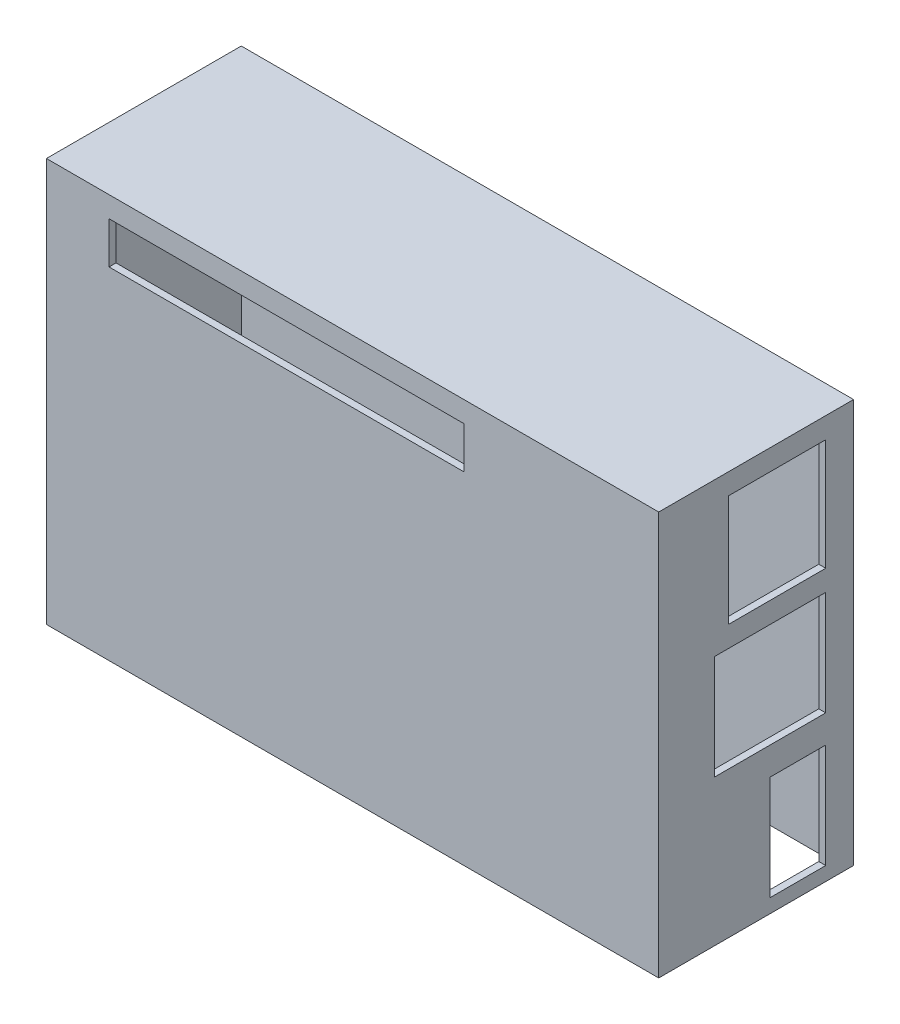
ISO-10303-21;
HEADER;
FILE_DESCRIPTION(('STEP AP214'),'2;1');
FILE_NAME('part.step','',(''),(''),'','','');
FILE_SCHEMA(('AUTOMOTIVE_DESIGN { 1 0 10303 214 1 1 1 1 }'));
ENDSEC;
DATA;
#1=APPLICATION_CONTEXT('core data for automotive mechanical design processes');
#2=APPLICATION_PROTOCOL_DEFINITION('international standard','automotive_design',2000,#1);
#3=PRODUCT_CONTEXT('',#1,'mechanical');
#4=PRODUCT('Part','Part','',(#3));
#5=PRODUCT_RELATED_PRODUCT_CATEGORY('part','',(#4));
#6=PRODUCT_DEFINITION_FORMATION('','',#4);
#7=PRODUCT_DEFINITION_CONTEXT('part definition',#1,'design');
#8=PRODUCT_DEFINITION('design','',#6,#7);
#9=PRODUCT_DEFINITION_SHAPE('','',#8);
#10=(LENGTH_UNIT() NAMED_UNIT(*) SI_UNIT(.MILLI.,.METRE.));
#11=(NAMED_UNIT(*) PLANE_ANGLE_UNIT() SI_UNIT($,.RADIAN.));
#12=(NAMED_UNIT(*) SI_UNIT($,.STERADIAN.) SOLID_ANGLE_UNIT());
#13=UNCERTAINTY_MEASURE_WITH_UNIT(LENGTH_MEASURE(1.E-05),#10,'distance_accuracy_value','');
#14=(GEOMETRIC_REPRESENTATION_CONTEXT(3) GLOBAL_UNCERTAINTY_ASSIGNED_CONTEXT((#13)) GLOBAL_UNIT_ASSIGNED_CONTEXT((#10,
#11,#12)) REPRESENTATION_CONTEXT('',''));
#15=CARTESIAN_POINT('',(0.,0.,0.));
#16=DIRECTION('',(0.,0.,1.));
#17=DIRECTION('',(1.,0.,0.));
#18=AXIS2_PLACEMENT_3D('',#15,#16,#17);
#19=CARTESIAN_POINT('',(48.734335839599,23.0982888080741,1.));
#20=DIRECTION('',(0.,0.,-1.));
#21=DIRECTION('',(0.,1.,0.));
#22=AXIS2_PLACEMENT_3D('',#19,#20,#21);
#23=PLANE('',#22);
#24=DIRECTION('',(0.,1.,0.));
#25=VECTOR('',#24,1.);
#26=CARTESIAN_POINT('',(-37.265664160401,23.0982888080741,1.));
#27=LINE('',#26,#25);
#28=CARTESIAN_POINT('',(-37.265664160401,-33.9017111919259,1.));
#29=VERTEX_POINT('',#28);
#30=CARTESIAN_POINT('',(-37.265664160401,23.0982888080741,1.));
#31=VERTEX_POINT('',#30);
#32=EDGE_CURVE('E52',#29,#31,#27,.T.);
#33=ORIENTED_EDGE('',*,*,#32,.F.);
#34=DIRECTION('',(1.,0.,0.));
#35=VECTOR('',#34,1.);
#36=CARTESIAN_POINT('',(-37.265664160401,-33.9017111919259,1.));
#37=LINE('',#36,#35);
#38=CARTESIAN_POINT('',(48.734335839599,-33.9017111919259,1.));
#39=VERTEX_POINT('',#38);
#40=EDGE_CURVE('E238',#29,#39,#37,.T.);
#41=ORIENTED_EDGE('',*,*,#40,.T.);
#42=DIRECTION('',(0.,-1.,0.));
#43=VECTOR('',#42,1.);
#44=CARTESIAN_POINT('',(48.734335839599,23.0982888080741,1.));
#45=LINE('',#44,#43);
#46=CARTESIAN_POINT('',(48.734335839599,23.0982888080741,1.));
#47=VERTEX_POINT('',#46);
#48=EDGE_CURVE('E226',#47,#39,#45,.T.);
#49=ORIENTED_EDGE('',*,*,#48,.F.);
#50=DIRECTION('',(-1.,0.,0.));
#51=VECTOR('',#50,1.);
#52=CARTESIAN_POINT('',(48.734335839599,23.0982888080741,1.));
#53=LINE('',#52,#51);
#54=EDGE_CURVE('E369',#47,#31,#53,.T.);
#55=ORIENTED_EDGE('',*,*,#54,.T.);
#56=EDGE_LOOP('',(#33,#41,#49,#55));
#57=FACE_BOUND('',#56,.T.);
#58=ADVANCED_FACE('F37',(#57),#23,.F.);
#59=CARTESIAN_POINT('',(48.734335839599,23.0982888080741,1.));
#60=DIRECTION('',(0.,1.,0.));
#61=DIRECTION('',(-1.,0.,0.));
#62=AXIS2_PLACEMENT_3D('',#59,#60,#61);
#63=PLANE('',#62);
#64=DIRECTION('',(0.,0.,1.));
#65=VECTOR('',#64,1.);
#66=CARTESIAN_POINT('',(-37.265664160401,23.0982888080741,1.));
#67=LINE('',#66,#65);
#68=CARTESIAN_POINT('',(-37.265664160401,23.0982888080741,27.));
#69=VERTEX_POINT('',#68);
#70=EDGE_CURVE('E303',#31,#69,#67,.T.);
#71=ORIENTED_EDGE('',*,*,#70,.F.);
#72=ORIENTED_EDGE('',*,*,#54,.F.);
#73=DIRECTION('',(0.,0.,-1.));
#74=VECTOR('',#73,1.);
#75=CARTESIAN_POINT('',(48.734335839599,23.0982888080741,1.));
#76=LINE('',#75,#74);
#77=CARTESIAN_POINT('',(48.734335839599,23.0982888080741,27.));
#78=VERTEX_POINT('',#77);
#79=EDGE_CURVE('E233',#78,#47,#76,.T.);
#80=ORIENTED_EDGE('',*,*,#79,.F.);
#81=DIRECTION('',(-1.,0.,0.));
#82=VECTOR('',#81,1.);
#83=CARTESIAN_POINT('',(48.734335839599,23.0982888080741,27.));
#84=LINE('',#83,#82);
#85=EDGE_CURVE('E368',#78,#69,#84,.T.);
#86=ORIENTED_EDGE('',*,*,#85,.T.);
#87=EDGE_LOOP('',(#71,#72,#80,#86));
#88=FACE_BOUND('',#87,.T.);
#89=ADVANCED_FACE('F468',(#88),#63,.F.);
#90=CARTESIAN_POINT('',(48.734335839599,23.0982888080741,27.));
#91=DIRECTION('',(0.,0.,1.));
#92=DIRECTION('',(0.,-1.,0.));
#93=AXIS2_PLACEMENT_3D('',#90,#91,#92);
#94=PLANE('',#93);
#95=DIRECTION('',(-1.,0.,0.));
#96=VECTOR('',#95,1.);
#97=CARTESIAN_POINT('',(48.734335839599,21.0982888080741,27.));
#98=LINE('',#97,#96);
#99=CARTESIAN_POINT('',(21.734335839599,21.0982888080741,27.));
#100=VERTEX_POINT('',#99);
#101=CARTESIAN_POINT('',(-29.265664160401,21.0982888080741,27.));
#102=VERTEX_POINT('',#101);
#103=EDGE_CURVE('E295',#100,#102,#98,.T.);
#104=ORIENTED_EDGE('',*,*,#103,.T.);
#105=DIRECTION('',(0.,-1.,0.));
#106=VECTOR('',#105,1.);
#107=CARTESIAN_POINT('',(-29.265664160401,23.0982888080742,27.));
#108=LINE('',#107,#106);
#109=CARTESIAN_POINT('',(-29.265664160401,15.0982888080741,27.));
#110=VERTEX_POINT('',#109);
#111=EDGE_CURVE('E298',#102,#110,#108,.T.);
#112=ORIENTED_EDGE('',*,*,#111,.T.);
#113=DIRECTION('',(1.,0.,0.));
#114=VECTOR('',#113,1.);
#115=CARTESIAN_POINT('',(48.734335839599,15.0982888080741,27.));
#116=LINE('',#115,#114);
#117=CARTESIAN_POINT('',(21.734335839599,15.0982888080741,27.));
#118=VERTEX_POINT('',#117);
#119=EDGE_CURVE('E283',#110,#118,#116,.T.);
#120=ORIENTED_EDGE('',*,*,#119,.T.);
#121=DIRECTION('',(0.,1.,0.));
#122=VECTOR('',#121,1.);
#123=CARTESIAN_POINT('',(21.734335839599,23.0982888080741,27.));
#124=LINE('',#123,#122);
#125=EDGE_CURVE('E292',#118,#100,#124,.T.);
#126=ORIENTED_EDGE('',*,*,#125,.T.);
#127=EDGE_LOOP('',(#104,#112,#120,#126));
#128=FACE_BOUND('',#127,.T.);
#129=DIRECTION('',(0.,-1.,0.));
#130=VECTOR('',#129,1.);
#131=CARTESIAN_POINT('',(-37.265664160401,23.0982888080741,27.));
#132=LINE('',#131,#130);
#133=CARTESIAN_POINT('',(-37.265664160401,-33.9017111919259,27.));
#134=VERTEX_POINT('',#133);
#135=EDGE_CURVE('E301',#69,#134,#132,.T.);
#136=ORIENTED_EDGE('',*,*,#135,.F.);
#137=ORIENTED_EDGE('',*,*,#85,.F.);
#138=DIRECTION('',(0.,1.,0.));
#139=VECTOR('',#138,1.);
#140=CARTESIAN_POINT('',(48.734335839599,23.0982888080741,27.));
#141=LINE('',#140,#139);
#142=CARTESIAN_POINT('',(48.734335839599,-33.9017111919259,27.));
#143=VERTEX_POINT('',#142);
#144=EDGE_CURVE('E234',#143,#78,#141,.T.);
#145=ORIENTED_EDGE('',*,*,#144,.F.);
#146=DIRECTION('',(-1.,0.,0.));
#147=VECTOR('',#146,1.);
#148=CARTESIAN_POINT('',(-37.265664160401,-33.9017111919259,27.));
#149=LINE('',#148,#147);
#150=EDGE_CURVE('E246',#143,#134,#149,.T.);
#151=ORIENTED_EDGE('',*,*,#150,.T.);
#152=EDGE_LOOP('',(#136,#137,#145,#151));
#153=FACE_BOUND('',#152,.T.);
#154=ADVANCED_FACE('F473',(#128,#153),#94,.F.);
#155=CARTESIAN_POINT('',(-38.265664160401,24.0982888080741,28.));
#156=DIRECTION('',(1.,0.,0.));
#157=DIRECTION('',(0.,1.,0.));
#158=AXIS2_PLACEMENT_3D('',#155,#156,#157);
#159=PLANE('',#158);
#160=DIRECTION('',(0.,0.,1.));
#161=VECTOR('',#160,1.);
#162=CARTESIAN_POINT('',(-38.265664160401,8.09828880807413,3.));
#163=LINE('',#162,#161);
#164=CARTESIAN_POINT('',(-38.265664160401,8.09828880807413,3.));
#165=VERTEX_POINT('',#164);
#166=CARTESIAN_POINT('',(-38.265664160401,8.09828880807413,8.));
#167=VERTEX_POINT('',#166);
#168=EDGE_CURVE('E252',#165,#167,#163,.T.);
#169=ORIENTED_EDGE('',*,*,#168,.F.);
#170=DIRECTION('',(0.,-1.,0.));
#171=VECTOR('',#170,1.);
#172=CARTESIAN_POINT('',(-38.265664160401,17.0982888080741,3.));
#173=LINE('',#172,#171);
#174=CARTESIAN_POINT('',(-38.265664160401,17.0982888080741,3.));
#175=VERTEX_POINT('',#174);
#176=EDGE_CURVE('E60',#175,#165,#173,.T.);
#177=ORIENTED_EDGE('',*,*,#176,.F.);
#178=DIRECTION('',(0.,0.,-1.));
#179=VECTOR('',#178,1.);
#180=CARTESIAN_POINT('',(-38.265664160401,17.0982888080741,3.));
#181=LINE('',#180,#179);
#182=CARTESIAN_POINT('',(-38.265664160401,17.0982888080741,8.));
#183=VERTEX_POINT('',#182);
#184=EDGE_CURVE('E258',#183,#175,#181,.T.);
#185=ORIENTED_EDGE('',*,*,#184,.F.);
#186=DIRECTION('',(0.,1.,0.));
#187=VECTOR('',#186,1.);
#188=CARTESIAN_POINT('',(-38.265664160401,17.0982888080741,8.));
#189=LINE('',#188,#187);
#190=EDGE_CURVE('E255',#167,#183,#189,.T.);
#191=ORIENTED_EDGE('',*,*,#190,.F.);
#192=EDGE_LOOP('',(#169,#177,#185,#191));
#193=FACE_BOUND('',#192,.T.);
#194=DIRECTION('',(0.,-1.,0.));
#195=VECTOR('',#194,1.);
#196=CARTESIAN_POINT('',(-38.265664160401,24.0982888080741,0.));
#197=LINE('',#196,#195);
#198=CARTESIAN_POINT('',(-38.265664160401,24.0982888080741,0.));
#199=VERTEX_POINT('',#198);
#200=CARTESIAN_POINT('',(-38.265664160401,-33.9017111919259,0.));
#201=VERTEX_POINT('',#200);
#202=EDGE_CURVE('E371',#199,#201,#197,.T.);
#203=ORIENTED_EDGE('',*,*,#202,.T.);
#204=DIRECTION('',(0.,0.,-1.));
#205=VECTOR('',#204,1.);
#206=CARTESIAN_POINT('',(-38.265664160401,-33.9017111919259,28.));
#207=LINE('',#206,#205);
#208=CARTESIAN_POINT('',(-38.265664160401,-33.9017111919259,28.));
#209=VERTEX_POINT('',#208);
#210=EDGE_CURVE('E400',#209,#201,#207,.T.);
#211=ORIENTED_EDGE('',*,*,#210,.F.);
#212=DIRECTION('',(0.,-1.,0.));
#213=VECTOR('',#212,1.);
#214=CARTESIAN_POINT('',(-38.265664160401,24.0982888080741,28.));
#215=LINE('',#214,#213);
#216=CARTESIAN_POINT('',(-38.265664160401,24.0982888080741,28.));
#217=VERTEX_POINT('',#216);
#218=EDGE_CURVE('E374',#217,#209,#215,.T.);
#219=ORIENTED_EDGE('',*,*,#218,.F.);
#220=DIRECTION('',(0.,0.,-1.));
#221=VECTOR('',#220,1.);
#222=CARTESIAN_POINT('',(-38.265664160401,24.0982888080741,28.));
#223=LINE('',#222,#221);
#224=EDGE_CURVE('E384',#217,#199,#223,.T.);
#225=ORIENTED_EDGE('',*,*,#224,.T.);
#226=EDGE_LOOP('',(#203,#211,#219,#225));
#227=FACE_BOUND('',#226,.T.);
#228=ADVANCED_FACE('F39',(#193,#227),#159,.F.);
#229=CARTESIAN_POINT('',(-38.265664160401,-33.9017111919259,28.));
#230=DIRECTION('',(0.,1.,0.));
#231=DIRECTION('',(0.,0.,1.));
#232=AXIS2_PLACEMENT_3D('',#229,#230,#231);
#233=PLANE('',#232);
#234=ORIENTED_EDGE('',*,*,#40,.F.);
#235=DIRECTION('',(0.,0.,-1.));
#236=VECTOR('',#235,1.);
#237=CARTESIAN_POINT('',(-37.265664160401,-33.9017111919259,27.));
#238=LINE('',#237,#236);
#239=EDGE_CURVE('E241',#134,#29,#238,.T.);
#240=ORIENTED_EDGE('',*,*,#239,.F.);
#241=ORIENTED_EDGE('',*,*,#150,.F.);
#242=DIRECTION('',(0.,0.,1.));
#243=VECTOR('',#242,1.);
#244=CARTESIAN_POINT('',(48.734335839599,-33.9017111919259,27.));
#245=LINE('',#244,#243);
#246=EDGE_CURVE('E230',#39,#143,#245,.T.);
#247=ORIENTED_EDGE('',*,*,#246,.F.);
#248=EDGE_LOOP('',(#234,#240,#241,#247));
#249=FACE_BOUND('',#248,.T.);
#250=DIRECTION('',(1.,0.,0.));
#251=VECTOR('',#250,1.);
#252=CARTESIAN_POINT('',(-38.265664160401,-33.9017111919259,0.));
#253=LINE('',#252,#251);
#254=CARTESIAN_POINT('',(49.734335839599,-33.9017111919259,0.));
#255=VERTEX_POINT('',#254);
#256=EDGE_CURVE('E387',#201,#255,#253,.T.);
#257=ORIENTED_EDGE('',*,*,#256,.T.);
#258=DIRECTION('',(0.,0.,-1.));
#259=VECTOR('',#258,1.);
#260=CARTESIAN_POINT('',(49.734335839599,-33.9017111919259,28.));
#261=LINE('',#260,#259);
#262=CARTESIAN_POINT('',(49.734335839599,-33.9017111919259,28.));
#263=VERTEX_POINT('',#262);
#264=EDGE_CURVE('E397',#263,#255,#261,.T.);
#265=ORIENTED_EDGE('',*,*,#264,.F.);
#266=DIRECTION('',(1.,0.,0.));
#267=VECTOR('',#266,1.);
#268=CARTESIAN_POINT('',(-38.265664160401,-33.9017111919259,28.));
#269=LINE('',#268,#267);
#270=EDGE_CURVE('E377',#209,#263,#269,.T.);
#271=ORIENTED_EDGE('',*,*,#270,.F.);
#272=ORIENTED_EDGE('',*,*,#210,.T.);
#273=EDGE_LOOP('',(#257,#265,#271,#272));
#274=FACE_BOUND('',#273,.T.);
#275=ADVANCED_FACE('F243',(#249,#274),#233,.F.);
#276=CARTESIAN_POINT('',(49.734335839599,24.0982888080741,28.));
#277=DIRECTION('',(-1.,0.,0.));
#278=DIRECTION('',(0.,-1.,0.));
#279=AXIS2_PLACEMENT_3D('',#276,#277,#278);
#280=PLANE('',#279);
#281=DIRECTION('',(0.,0.,1.));
#282=VECTOR('',#281,1.);
#283=CARTESIAN_POINT('',(49.734335839599,-16.9017111919259,4.));
#284=LINE('',#283,#282);
#285=CARTESIAN_POINT('',(49.734335839599,-16.9017111919259,4.));
#286=VERTEX_POINT('',#285);
#287=CARTESIAN_POINT('',(49.734335839599,-16.9017111919259,12.));
#288=VERTEX_POINT('',#287);
#289=EDGE_CURVE('E310',#286,#288,#284,.T.);
#290=ORIENTED_EDGE('',*,*,#289,.F.);
#291=DIRECTION('',(0.,1.,0.));
#292=VECTOR('',#291,1.);
#293=CARTESIAN_POINT('',(49.734335839599,-31.9017111919259,4.));
#294=LINE('',#293,#292);
#295=CARTESIAN_POINT('',(49.734335839599,-31.9017111919259,4.));
#296=VERTEX_POINT('',#295);
#297=EDGE_CURVE('E308',#296,#286,#294,.T.);
#298=ORIENTED_EDGE('',*,*,#297,.F.);
#299=DIRECTION('',(0.,0.,-1.));
#300=VECTOR('',#299,1.);
#301=CARTESIAN_POINT('',(49.734335839599,-31.9017111919259,4.));
#302=LINE('',#301,#300);
#303=CARTESIAN_POINT('',(49.734335839599,-31.9017111919259,12.));
#304=VERTEX_POINT('',#303);
#305=EDGE_CURVE('E317',#304,#296,#302,.T.);
#306=ORIENTED_EDGE('',*,*,#305,.F.);
#307=DIRECTION('',(0.,-1.,0.));
#308=VECTOR('',#307,1.);
#309=CARTESIAN_POINT('',(49.734335839599,-31.9017111919259,12.));
#310=LINE('',#309,#308);
#311=EDGE_CURVE('E314',#288,#304,#310,.T.);
#312=ORIENTED_EDGE('',*,*,#311,.F.);
#313=EDGE_LOOP('',(#290,#298,#306,#312));
#314=FACE_BOUND('',#313,.T.);
#315=DIRECTION('',(0.,0.,1.));
#316=VECTOR('',#315,1.);
#317=CARTESIAN_POINT('',(49.734335839599,2.09828880807412,4.));
#318=LINE('',#317,#316);
#319=CARTESIAN_POINT('',(49.734335839599,2.09828880807412,4.));
#320=VERTEX_POINT('',#319);
#321=CARTESIAN_POINT('',(49.734335839599,2.09828880807412,20.));
#322=VERTEX_POINT('',#321);
#323=EDGE_CURVE('E330',#320,#322,#318,.T.);
#324=ORIENTED_EDGE('',*,*,#323,.F.);
#325=DIRECTION('',(0.,1.,0.));
#326=VECTOR('',#325,1.);
#327=CARTESIAN_POINT('',(49.734335839599,-12.9017111919259,4.));
#328=LINE('',#327,#326);
#329=CARTESIAN_POINT('',(49.734335839599,-12.9017111919259,4.));
#330=VERTEX_POINT('',#329);
#331=EDGE_CURVE('E328',#330,#320,#328,.T.);
#332=ORIENTED_EDGE('',*,*,#331,.F.);
#333=DIRECTION('',(0.,0.,-1.));
#334=VECTOR('',#333,1.);
#335=CARTESIAN_POINT('',(49.734335839599,-12.9017111919259,4.));
#336=LINE('',#335,#334);
#337=CARTESIAN_POINT('',(49.734335839599,-12.9017111919259,20.));
#338=VERTEX_POINT('',#337);
#339=EDGE_CURVE('E337',#338,#330,#336,.T.);
#340=ORIENTED_EDGE('',*,*,#339,.F.);
#341=DIRECTION('',(0.,-1.,0.));
#342=VECTOR('',#341,1.);
#343=CARTESIAN_POINT('',(49.734335839599,-12.9017111919259,20.));
#344=LINE('',#343,#342);
#345=EDGE_CURVE('E334',#322,#338,#344,.T.);
#346=ORIENTED_EDGE('',*,*,#345,.F.);
#347=EDGE_LOOP('',(#324,#332,#340,#346));
#348=FACE_BOUND('',#347,.T.);
#349=DIRECTION('',(0.,0.,1.));
#350=VECTOR('',#349,1.);
#351=CARTESIAN_POINT('',(49.734335839599,21.0982888080741,4.));
#352=LINE('',#351,#350);
#353=CARTESIAN_POINT('',(49.734335839599,21.0982888080741,4.));
#354=VERTEX_POINT('',#353);
#355=CARTESIAN_POINT('',(49.734335839599,21.0982888080741,18.));
#356=VERTEX_POINT('',#355);
#357=EDGE_CURVE('E349',#354,#356,#352,.T.);
#358=ORIENTED_EDGE('',*,*,#357,.F.);
#359=DIRECTION('',(0.,1.,0.));
#360=VECTOR('',#359,1.);
#361=CARTESIAN_POINT('',(49.734335839599,5.09828880807412,4.));
#362=LINE('',#361,#360);
#363=CARTESIAN_POINT('',(49.734335839599,5.09828880807412,4.));
#364=VERTEX_POINT('',#363);
#365=EDGE_CURVE('E307',#364,#354,#362,.T.);
#366=ORIENTED_EDGE('',*,*,#365,.F.);
#367=DIRECTION('',(0.,0.,-1.));
#368=VECTOR('',#367,1.);
#369=CARTESIAN_POINT('',(49.734335839599,5.09828880807412,4.));
#370=LINE('',#369,#368);
#371=CARTESIAN_POINT('',(49.734335839599,5.09828880807412,18.));
#372=VERTEX_POINT('',#371);
#373=EDGE_CURVE('E355',#372,#364,#370,.T.);
#374=ORIENTED_EDGE('',*,*,#373,.F.);
#375=DIRECTION('',(0.,-1.,0.));
#376=VECTOR('',#375,1.);
#377=CARTESIAN_POINT('',(49.734335839599,5.09828880807412,18.));
#378=LINE('',#377,#376);
#379=EDGE_CURVE('E352',#356,#372,#378,.T.);
#380=ORIENTED_EDGE('',*,*,#379,.F.);
#381=EDGE_LOOP('',(#358,#366,#374,#380));
#382=FACE_BOUND('',#381,.T.);
#383=DIRECTION('',(0.,1.,0.));
#384=VECTOR('',#383,1.);
#385=CARTESIAN_POINT('',(49.734335839599,24.0982888080741,0.));
#386=LINE('',#385,#384);
#387=CARTESIAN_POINT('',(49.734335839599,24.0982888080741,0.));
#388=VERTEX_POINT('',#387);
#389=EDGE_CURVE('E389',#255,#388,#386,.T.);
#390=ORIENTED_EDGE('',*,*,#389,.T.);
#391=DIRECTION('',(0.,0.,-1.));
#392=VECTOR('',#391,1.);
#393=CARTESIAN_POINT('',(49.734335839599,24.0982888080741,28.));
#394=LINE('',#393,#392);
#395=CARTESIAN_POINT('',(49.734335839599,24.0982888080741,28.));
#396=VERTEX_POINT('',#395);
#397=EDGE_CURVE('E394',#396,#388,#394,.T.);
#398=ORIENTED_EDGE('',*,*,#397,.F.);
#399=DIRECTION('',(0.,1.,0.));
#400=VECTOR('',#399,1.);
#401=CARTESIAN_POINT('',(49.734335839599,24.0982888080741,28.));
#402=LINE('',#401,#400);
#403=EDGE_CURVE('E380',#263,#396,#402,.T.);
#404=ORIENTED_EDGE('',*,*,#403,.F.);
#405=ORIENTED_EDGE('',*,*,#264,.T.);
#406=EDGE_LOOP('',(#390,#398,#404,#405));
#407=FACE_BOUND('',#406,.T.);
#408=ADVANCED_FACE('F489',(#314,#348,#382,#407),#280,.F.);
#409=CARTESIAN_POINT('',(-38.265664160401,24.0982888080741,28.));
#410=DIRECTION('',(0.,-1.,0.));
#411=DIRECTION('',(0.,0.,-1.));
#412=AXIS2_PLACEMENT_3D('',#409,#410,#411);
#413=PLANE('',#412);
#414=ORIENTED_EDGE('',*,*,#224,.F.);
#415=DIRECTION('',(-1.,0.,0.));
#416=VECTOR('',#415,1.);
#417=CARTESIAN_POINT('',(-38.265664160401,24.0982888080741,28.));
#418=LINE('',#417,#416);
#419=EDGE_CURVE('E382',#396,#217,#418,.T.);
#420=ORIENTED_EDGE('',*,*,#419,.F.);
#421=ORIENTED_EDGE('',*,*,#397,.T.);
#422=DIRECTION('',(-1.,0.,0.));
#423=VECTOR('',#422,1.);
#424=CARTESIAN_POINT('',(-38.265664160401,24.0982888080741,0.));
#425=LINE('',#424,#423);
#426=EDGE_CURVE('E378',#388,#199,#425,.T.);
#427=ORIENTED_EDGE('',*,*,#426,.T.);
#428=EDGE_LOOP('',(#414,#420,#421,#427));
#429=FACE_BOUND('',#428,.T.);
#430=ADVANCED_FACE('F482',(#429),#413,.F.);
#431=CARTESIAN_POINT('',(0.,0.,28.));
#432=DIRECTION('',(0.,0.,1.));
#433=DIRECTION('',(1.,0.,0.));
#434=AXIS2_PLACEMENT_3D('',#431,#432,#433);
#435=PLANE('',#434);
#436=DIRECTION('',(0.,-1.,0.));
#437=VECTOR('',#436,1.);
#438=CARTESIAN_POINT('',(-29.265664160401,21.0982888080741,28.));
#439=LINE('',#438,#437);
#440=CARTESIAN_POINT('',(-29.265664160401,21.0982888080741,28.));
#441=VERTEX_POINT('',#440);
#442=CARTESIAN_POINT('',(-29.265664160401,15.0982888080741,28.));
#443=VERTEX_POINT('',#442);
#444=EDGE_CURVE('E264',#441,#443,#439,.T.);
#445=ORIENTED_EDGE('',*,*,#444,.F.);
#446=DIRECTION('',(-1.,0.,0.));
#447=VECTOR('',#446,1.);
#448=CARTESIAN_POINT('',(-29.265664160401,21.0982888080741,28.));
#449=LINE('',#448,#447);
#450=CARTESIAN_POINT('',(21.734335839599,21.0982888080741,28.));
#451=VERTEX_POINT('',#450);
#452=EDGE_CURVE('E277',#451,#441,#449,.T.);
#453=ORIENTED_EDGE('',*,*,#452,.F.);
#454=DIRECTION('',(0.,1.,0.));
#455=VECTOR('',#454,1.);
#456=CARTESIAN_POINT('',(21.734335839599,21.0982888080741,28.));
#457=LINE('',#456,#455);
#458=CARTESIAN_POINT('',(21.734335839599,15.0982888080741,28.));
#459=VERTEX_POINT('',#458);
#460=EDGE_CURVE('E274',#459,#451,#457,.T.);
#461=ORIENTED_EDGE('',*,*,#460,.F.);
#462=DIRECTION('',(1.,0.,0.));
#463=VECTOR('',#462,1.);
#464=CARTESIAN_POINT('',(-29.265664160401,15.0982888080741,28.));
#465=LINE('',#464,#463);
#466=EDGE_CURVE('E271',#443,#459,#465,.T.);
#467=ORIENTED_EDGE('',*,*,#466,.F.);
#468=EDGE_LOOP('',(#445,#453,#461,#467));
#469=FACE_BOUND('',#468,.T.);
#470=ORIENTED_EDGE('',*,*,#270,.T.);
#471=ORIENTED_EDGE('',*,*,#403,.T.);
#472=ORIENTED_EDGE('',*,*,#419,.T.);
#473=ORIENTED_EDGE('',*,*,#218,.T.);
#474=EDGE_LOOP('',(#470,#471,#472,#473));
#475=FACE_BOUND('',#474,.T.);
#476=ADVANCED_FACE('F478',(#469,#475),#435,.T.);
#477=CARTESIAN_POINT('',(0.,0.,0.));
#478=DIRECTION('',(0.,0.,1.));
#479=DIRECTION('',(1.,0.,0.));
#480=AXIS2_PLACEMENT_3D('',#477,#478,#479);
#481=PLANE('',#480);
#482=ORIENTED_EDGE('',*,*,#202,.F.);
#483=ORIENTED_EDGE('',*,*,#426,.F.);
#484=ORIENTED_EDGE('',*,*,#389,.F.);
#485=ORIENTED_EDGE('',*,*,#256,.F.);
#486=EDGE_LOOP('',(#482,#483,#484,#485));
#487=FACE_BOUND('',#486,.T.);
#488=ADVANCED_FACE('F481',(#487),#481,.F.);
#489=CARTESIAN_POINT('',(48.734335839599,0.,0.));
#490=DIRECTION('',(-1.,0.,0.));
#491=DIRECTION('',(0.,-1.,0.));
#492=AXIS2_PLACEMENT_3D('',#489,#490,#491);
#493=PLANE('',#492);
#494=DIRECTION('',(0.,-1.,0.));
#495=VECTOR('',#494,1.);
#496=CARTESIAN_POINT('',(48.734335839599,0.,4.));
#497=LINE('',#496,#495);
#498=CARTESIAN_POINT('',(48.734335839599,-16.9017111919259,4.));
#499=VERTEX_POINT('',#498);
#500=CARTESIAN_POINT('',(48.734335839599,-31.9017111919259,4.));
#501=VERTEX_POINT('',#500);
#502=EDGE_CURVE('E428',#499,#501,#497,.T.);
#503=ORIENTED_EDGE('',*,*,#502,.F.);
#504=DIRECTION('',(0.,0.,-1.));
#505=VECTOR('',#504,1.);
#506=CARTESIAN_POINT('',(48.734335839599,-16.9017111919259,0.));
#507=LINE('',#506,#505);
#508=CARTESIAN_POINT('',(48.734335839599,-16.9017111919259,12.));
#509=VERTEX_POINT('',#508);
#510=EDGE_CURVE('E421',#509,#499,#507,.T.);
#511=ORIENTED_EDGE('',*,*,#510,.F.);
#512=DIRECTION('',(0.,1.,0.));
#513=VECTOR('',#512,1.);
#514=CARTESIAN_POINT('',(48.734335839599,0.,12.));
#515=LINE('',#514,#513);
#516=CARTESIAN_POINT('',(48.734335839599,-31.9017111919259,12.));
#517=VERTEX_POINT('',#516);
#518=EDGE_CURVE('E423',#517,#509,#515,.T.);
#519=ORIENTED_EDGE('',*,*,#518,.F.);
#520=DIRECTION('',(0.,0.,1.));
#521=VECTOR('',#520,1.);
#522=CARTESIAN_POINT('',(48.734335839599,-31.9017111919259,0.));
#523=LINE('',#522,#521);
#524=EDGE_CURVE('E426',#501,#517,#523,.T.);
#525=ORIENTED_EDGE('',*,*,#524,.F.);
#526=EDGE_LOOP('',(#503,#511,#519,#525));
#527=FACE_BOUND('',#526,.T.);
#528=DIRECTION('',(0.,-1.,0.));
#529=VECTOR('',#528,1.);
#530=CARTESIAN_POINT('',(48.734335839599,0.,4.));
#531=LINE('',#530,#529);
#532=CARTESIAN_POINT('',(48.734335839599,2.09828880807412,4.));
#533=VERTEX_POINT('',#532);
#534=CARTESIAN_POINT('',(48.734335839599,-12.9017111919259,4.));
#535=VERTEX_POINT('',#534);
#536=EDGE_CURVE('E419',#533,#535,#531,.T.);
#537=ORIENTED_EDGE('',*,*,#536,.F.);
#538=DIRECTION('',(0.,0.,-1.));
#539=VECTOR('',#538,1.);
#540=CARTESIAN_POINT('',(48.734335839599,2.09828880807412,0.));
#541=LINE('',#540,#539);
#542=CARTESIAN_POINT('',(48.734335839599,2.09828880807412,20.));
#543=VERTEX_POINT('',#542);
#544=EDGE_CURVE('E412',#543,#533,#541,.T.);
#545=ORIENTED_EDGE('',*,*,#544,.F.);
#546=DIRECTION('',(0.,1.,0.));
#547=VECTOR('',#546,1.);
#548=CARTESIAN_POINT('',(48.734335839599,0.,20.));
#549=LINE('',#548,#547);
#550=CARTESIAN_POINT('',(48.734335839599,-12.9017111919259,20.));
#551=VERTEX_POINT('',#550);
#552=EDGE_CURVE('E414',#551,#543,#549,.T.);
#553=ORIENTED_EDGE('',*,*,#552,.F.);
#554=DIRECTION('',(0.,0.,1.));
#555=VECTOR('',#554,1.);
#556=CARTESIAN_POINT('',(48.734335839599,-12.9017111919259,0.));
#557=LINE('',#556,#555);
#558=EDGE_CURVE('E417',#535,#551,#557,.T.);
#559=ORIENTED_EDGE('',*,*,#558,.F.);
#560=EDGE_LOOP('',(#537,#545,#553,#559));
#561=FACE_BOUND('',#560,.T.);
#562=DIRECTION('',(0.,-1.,0.));
#563=VECTOR('',#562,1.);
#564=CARTESIAN_POINT('',(48.734335839599,0.,4.));
#565=LINE('',#564,#563);
#566=CARTESIAN_POINT('',(48.734335839599,21.0982888080741,4.));
#567=VERTEX_POINT('',#566);
#568=CARTESIAN_POINT('',(48.734335839599,5.09828880807412,4.));
#569=VERTEX_POINT('',#568);
#570=EDGE_CURVE('E410',#567,#569,#565,.T.);
#571=ORIENTED_EDGE('',*,*,#570,.F.);
#572=DIRECTION('',(0.,0.,-1.));
#573=VECTOR('',#572,1.);
#574=CARTESIAN_POINT('',(48.734335839599,21.0982888080741,0.));
#575=LINE('',#574,#573);
#576=CARTESIAN_POINT('',(48.734335839599,21.0982888080741,18.));
#577=VERTEX_POINT('',#576);
#578=EDGE_CURVE('E403',#577,#567,#575,.T.);
#579=ORIENTED_EDGE('',*,*,#578,.F.);
#580=DIRECTION('',(0.,1.,0.));
#581=VECTOR('',#580,1.);
#582=CARTESIAN_POINT('',(48.734335839599,0.,18.));
#583=LINE('',#582,#581);
#584=CARTESIAN_POINT('',(48.734335839599,5.09828880807412,18.));
#585=VERTEX_POINT('',#584);
#586=EDGE_CURVE('E405',#585,#577,#583,.T.);
#587=ORIENTED_EDGE('',*,*,#586,.F.);
#588=DIRECTION('',(0.,0.,1.));
#589=VECTOR('',#588,1.);
#590=CARTESIAN_POINT('',(48.734335839599,5.09828880807412,0.));
#591=LINE('',#590,#589);
#592=EDGE_CURVE('E408',#569,#585,#591,.T.);
#593=ORIENTED_EDGE('',*,*,#592,.F.);
#594=EDGE_LOOP('',(#571,#579,#587,#593));
#595=FACE_BOUND('',#594,.T.);
#596=ORIENTED_EDGE('',*,*,#48,.T.);
#597=ORIENTED_EDGE('',*,*,#246,.T.);
#598=ORIENTED_EDGE('',*,*,#144,.T.);
#599=ORIENTED_EDGE('',*,*,#79,.T.);
#600=EDGE_LOOP('',(#596,#597,#598,#599));
#601=FACE_BOUND('',#600,.T.);
#602=ADVANCED_FACE('F227',(#527,#561,#595,#601),#493,.T.);
#603=CARTESIAN_POINT('',(-37.265664160401,5.09828880807409,4.));
#604=DIRECTION('',(0.,0.,-1.));
#605=DIRECTION('',(0.,1.,0.));
#606=AXIS2_PLACEMENT_3D('',#603,#604,#605);
#607=PLANE('',#606);
#608=ORIENTED_EDGE('',*,*,#570,.T.);
#609=DIRECTION('',(1.,0.,0.));
#610=VECTOR('',#609,1.);
#611=CARTESIAN_POINT('',(-37.265664160401,5.09828880807409,4.));
#612=LINE('',#611,#610);
#613=EDGE_CURVE('E331',#569,#364,#612,.T.);
#614=ORIENTED_EDGE('',*,*,#613,.T.);
#615=ORIENTED_EDGE('',*,*,#365,.T.);
#616=DIRECTION('',(1.,0.,0.));
#617=VECTOR('',#616,1.);
#618=CARTESIAN_POINT('',(-37.265664160401,21.0982888080741,4.));
#619=LINE('',#618,#617);
#620=EDGE_CURVE('E358',#567,#354,#619,.T.);
#621=ORIENTED_EDGE('',*,*,#620,.F.);
#622=EDGE_LOOP('',(#608,#614,#615,#621));
#623=FACE_BOUND('',#622,.T.);
#624=ADVANCED_FACE('F551',(#623),#607,.F.);
#625=CARTESIAN_POINT('',(-37.265664160401,5.09828880807409,4.));
#626=DIRECTION('',(0.,-1.,0.));
#627=DIRECTION('',(1.,0.,0.));
#628=AXIS2_PLACEMENT_3D('',#625,#626,#627);
#629=PLANE('',#628);
#630=ORIENTED_EDGE('',*,*,#592,.T.);
#631=DIRECTION('',(1.,0.,0.));
#632=VECTOR('',#631,1.);
#633=CARTESIAN_POINT('',(-37.265664160401,5.09828880807409,18.));
#634=LINE('',#633,#632);
#635=EDGE_CURVE('E360',#585,#372,#634,.T.);
#636=ORIENTED_EDGE('',*,*,#635,.T.);
#637=ORIENTED_EDGE('',*,*,#373,.T.);
#638=ORIENTED_EDGE('',*,*,#613,.F.);
#639=EDGE_LOOP('',(#630,#636,#637,#638));
#640=FACE_BOUND('',#639,.T.);
#641=ADVANCED_FACE('F547',(#640),#629,.F.);
#642=CARTESIAN_POINT('',(-37.265664160401,5.09828880807409,18.));
#643=DIRECTION('',(0.,0.,1.));
#644=DIRECTION('',(1.,0.,0.));
#645=AXIS2_PLACEMENT_3D('',#642,#643,#644);
#646=PLANE('',#645);
#647=ORIENTED_EDGE('',*,*,#586,.T.);
#648=DIRECTION('',(1.,0.,0.));
#649=VECTOR('',#648,1.);
#650=CARTESIAN_POINT('',(-37.265664160401,21.0982888080741,18.));
#651=LINE('',#650,#649);
#652=EDGE_CURVE('E362',#577,#356,#651,.T.);
#653=ORIENTED_EDGE('',*,*,#652,.T.);
#654=ORIENTED_EDGE('',*,*,#379,.T.);
#655=ORIENTED_EDGE('',*,*,#635,.F.);
#656=EDGE_LOOP('',(#647,#653,#654,#655));
#657=FACE_BOUND('',#656,.T.);
#658=ADVANCED_FACE('F550',(#657),#646,.F.);
#659=CARTESIAN_POINT('',(-37.265664160401,21.0982888080741,4.));
#660=DIRECTION('',(0.,1.,0.));
#661=DIRECTION('',(-1.,0.,0.));
#662=AXIS2_PLACEMENT_3D('',#659,#660,#661);
#663=PLANE('',#662);
#664=ORIENTED_EDGE('',*,*,#578,.T.);
#665=ORIENTED_EDGE('',*,*,#620,.T.);
#666=ORIENTED_EDGE('',*,*,#357,.T.);
#667=ORIENTED_EDGE('',*,*,#652,.F.);
#668=EDGE_LOOP('',(#664,#665,#666,#667));
#669=FACE_BOUND('',#668,.T.);
#670=ADVANCED_FACE('F545',(#669),#663,.F.);
#671=CARTESIAN_POINT('',(-37.265664160401,-12.9017111919259,4.));
#672=DIRECTION('',(0.,0.,-1.));
#673=DIRECTION('',(0.,1.,0.));
#674=AXIS2_PLACEMENT_3D('',#671,#672,#673);
#675=PLANE('',#674);
#676=ORIENTED_EDGE('',*,*,#536,.T.);
#677=DIRECTION('',(1.,0.,0.));
#678=VECTOR('',#677,1.);
#679=CARTESIAN_POINT('',(-37.265664160401,-12.9017111919259,4.));
#680=LINE('',#679,#678);
#681=EDGE_CURVE('E311',#535,#330,#680,.T.);
#682=ORIENTED_EDGE('',*,*,#681,.T.);
#683=ORIENTED_EDGE('',*,*,#331,.T.);
#684=DIRECTION('',(1.,0.,0.));
#685=VECTOR('',#684,1.);
#686=CARTESIAN_POINT('',(-37.265664160401,2.09828880807409,4.));
#687=LINE('',#686,#685);
#688=EDGE_CURVE('E340',#533,#320,#687,.T.);
#689=ORIENTED_EDGE('',*,*,#688,.F.);
#690=EDGE_LOOP('',(#676,#682,#683,#689));
#691=FACE_BOUND('',#690,.T.);
#692=ADVANCED_FACE('F535',(#691),#675,.F.);
#693=CARTESIAN_POINT('',(-37.265664160401,-12.9017111919259,4.));
#694=DIRECTION('',(0.,-1.,0.));
#695=DIRECTION('',(1.,0.,0.));
#696=AXIS2_PLACEMENT_3D('',#693,#694,#695);
#697=PLANE('',#696);
#698=ORIENTED_EDGE('',*,*,#558,.T.);
#699=DIRECTION('',(1.,0.,0.));
#700=VECTOR('',#699,1.);
#701=CARTESIAN_POINT('',(-37.265664160401,-12.9017111919259,20.));
#702=LINE('',#701,#700);
#703=EDGE_CURVE('E342',#551,#338,#702,.T.);
#704=ORIENTED_EDGE('',*,*,#703,.T.);
#705=ORIENTED_EDGE('',*,*,#339,.T.);
#706=ORIENTED_EDGE('',*,*,#681,.F.);
#707=EDGE_LOOP('',(#698,#704,#705,#706));
#708=FACE_BOUND('',#707,.T.);
#709=ADVANCED_FACE('F531',(#708),#697,.F.);
#710=CARTESIAN_POINT('',(-37.265664160401,-12.9017111919259,20.));
#711=DIRECTION('',(0.,0.,1.));
#712=DIRECTION('',(1.,0.,0.));
#713=AXIS2_PLACEMENT_3D('',#710,#711,#712);
#714=PLANE('',#713);
#715=ORIENTED_EDGE('',*,*,#552,.T.);
#716=DIRECTION('',(1.,0.,0.));
#717=VECTOR('',#716,1.);
#718=CARTESIAN_POINT('',(-37.265664160401,2.09828880807409,20.));
#719=LINE('',#718,#717);
#720=EDGE_CURVE('E344',#543,#322,#719,.T.);
#721=ORIENTED_EDGE('',*,*,#720,.T.);
#722=ORIENTED_EDGE('',*,*,#345,.T.);
#723=ORIENTED_EDGE('',*,*,#703,.F.);
#724=EDGE_LOOP('',(#715,#721,#722,#723));
#725=FACE_BOUND('',#724,.T.);
#726=ADVANCED_FACE('F534',(#725),#714,.F.);
#727=CARTESIAN_POINT('',(-37.265664160401,2.09828880807409,4.));
#728=DIRECTION('',(0.,1.,0.));
#729=DIRECTION('',(-1.,0.,0.));
#730=AXIS2_PLACEMENT_3D('',#727,#728,#729);
#731=PLANE('',#730);
#732=ORIENTED_EDGE('',*,*,#544,.T.);
#733=ORIENTED_EDGE('',*,*,#688,.T.);
#734=ORIENTED_EDGE('',*,*,#323,.T.);
#735=ORIENTED_EDGE('',*,*,#720,.F.);
#736=EDGE_LOOP('',(#732,#733,#734,#735));
#737=FACE_BOUND('',#736,.T.);
#738=ADVANCED_FACE('F529',(#737),#731,.F.);
#739=CARTESIAN_POINT('',(-37.265664160401,-31.9017111919259,4.));
#740=DIRECTION('',(0.,0.,-1.));
#741=DIRECTION('',(0.,1.,0.));
#742=AXIS2_PLACEMENT_3D('',#739,#740,#741);
#743=PLANE('',#742);
#744=ORIENTED_EDGE('',*,*,#502,.T.);
#745=DIRECTION('',(1.,0.,0.));
#746=VECTOR('',#745,1.);
#747=CARTESIAN_POINT('',(-37.265664160401,-31.9017111919259,4.));
#748=LINE('',#747,#746);
#749=EDGE_CURVE('E235',#501,#296,#748,.T.);
#750=ORIENTED_EDGE('',*,*,#749,.T.);
#751=ORIENTED_EDGE('',*,*,#297,.T.);
#752=DIRECTION('',(1.,0.,0.));
#753=VECTOR('',#752,1.);
#754=CARTESIAN_POINT('',(-37.265664160401,-16.9017111919259,4.));
#755=LINE('',#754,#753);
#756=EDGE_CURVE('E320',#499,#286,#755,.T.);
#757=ORIENTED_EDGE('',*,*,#756,.F.);
#758=EDGE_LOOP('',(#744,#750,#751,#757));
#759=FACE_BOUND('',#758,.T.);
#760=ADVANCED_FACE('F522',(#759),#743,.F.);
#761=CARTESIAN_POINT('',(-37.265664160401,-31.9017111919259,4.));
#762=DIRECTION('',(0.,-1.,0.));
#763=DIRECTION('',(1.,0.,0.));
#764=AXIS2_PLACEMENT_3D('',#761,#762,#763);
#765=PLANE('',#764);
#766=ORIENTED_EDGE('',*,*,#524,.T.);
#767=DIRECTION('',(1.,0.,0.));
#768=VECTOR('',#767,1.);
#769=CARTESIAN_POINT('',(-37.265664160401,-31.9017111919259,12.));
#770=LINE('',#769,#768);
#771=EDGE_CURVE('E322',#517,#304,#770,.T.);
#772=ORIENTED_EDGE('',*,*,#771,.T.);
#773=ORIENTED_EDGE('',*,*,#305,.T.);
#774=ORIENTED_EDGE('',*,*,#749,.F.);
#775=EDGE_LOOP('',(#766,#772,#773,#774));
#776=FACE_BOUND('',#775,.T.);
#777=ADVANCED_FACE('F519',(#776),#765,.F.);
#778=CARTESIAN_POINT('',(-37.265664160401,-31.9017111919259,12.));
#779=DIRECTION('',(0.,0.,1.));
#780=DIRECTION('',(1.,0.,0.));
#781=AXIS2_PLACEMENT_3D('',#778,#779,#780);
#782=PLANE('',#781);
#783=ORIENTED_EDGE('',*,*,#518,.T.);
#784=DIRECTION('',(1.,0.,0.));
#785=VECTOR('',#784,1.);
#786=CARTESIAN_POINT('',(-37.265664160401,-16.9017111919259,12.));
#787=LINE('',#786,#785);
#788=EDGE_CURVE('E324',#509,#288,#787,.T.);
#789=ORIENTED_EDGE('',*,*,#788,.T.);
#790=ORIENTED_EDGE('',*,*,#311,.T.);
#791=ORIENTED_EDGE('',*,*,#771,.F.);
#792=EDGE_LOOP('',(#783,#789,#790,#791));
#793=FACE_BOUND('',#792,.T.);
#794=ADVANCED_FACE('F515',(#793),#782,.F.);
#795=CARTESIAN_POINT('',(-37.265664160401,-16.9017111919259,4.));
#796=DIRECTION('',(0.,1.,0.));
#797=DIRECTION('',(-1.,0.,0.));
#798=AXIS2_PLACEMENT_3D('',#795,#796,#797);
#799=PLANE('',#798);
#800=ORIENTED_EDGE('',*,*,#510,.T.);
#801=ORIENTED_EDGE('',*,*,#756,.T.);
#802=ORIENTED_EDGE('',*,*,#289,.T.);
#803=ORIENTED_EDGE('',*,*,#788,.F.);
#804=EDGE_LOOP('',(#800,#801,#802,#803));
#805=FACE_BOUND('',#804,.T.);
#806=ADVANCED_FACE('F506',(#805),#799,.F.);
#807=CARTESIAN_POINT('',(-37.265664160401,0.,0.));
#808=DIRECTION('',(-1.,0.,0.));
#809=DIRECTION('',(0.,-1.,0.));
#810=AXIS2_PLACEMENT_3D('',#807,#808,#809);
#811=PLANE('',#810);
#812=DIRECTION('',(0.,0.,-1.));
#813=VECTOR('',#812,1.);
#814=CARTESIAN_POINT('',(-37.265664160401,17.0982888080741,0.));
#815=LINE('',#814,#813);
#816=CARTESIAN_POINT('',(-37.265664160401,17.0982888080741,8.));
#817=VERTEX_POINT('',#816);
#818=CARTESIAN_POINT('',(-37.265664160401,17.0982888080741,3.));
#819=VERTEX_POINT('',#818);
#820=EDGE_CURVE('E45',#817,#819,#815,.T.);
#821=ORIENTED_EDGE('',*,*,#820,.T.);
#822=DIRECTION('',(0.,-1.,0.));
#823=VECTOR('',#822,1.);
#824=CARTESIAN_POINT('',(-37.265664160401,0.,3.));
#825=LINE('',#824,#823);
#826=CARTESIAN_POINT('',(-37.265664160401,8.09828880807413,3.));
#827=VERTEX_POINT('',#826);
#828=EDGE_CURVE('E11',#819,#827,#825,.T.);
#829=ORIENTED_EDGE('',*,*,#828,.T.);
#830=DIRECTION('',(0.,0.,1.));
#831=VECTOR('',#830,1.);
#832=CARTESIAN_POINT('',(-37.265664160401,8.09828880807413,0.));
#833=LINE('',#832,#831);
#834=CARTESIAN_POINT('',(-37.265664160401,8.09828880807413,8.));
#835=VERTEX_POINT('',#834);
#836=EDGE_CURVE('E430',#827,#835,#833,.T.);
#837=ORIENTED_EDGE('',*,*,#836,.T.);
#838=DIRECTION('',(0.,1.,0.));
#839=VECTOR('',#838,1.);
#840=CARTESIAN_POINT('',(-37.265664160401,0.,8.));
#841=LINE('',#840,#839);
#842=EDGE_CURVE('E433',#835,#817,#841,.T.);
#843=ORIENTED_EDGE('',*,*,#842,.T.);
#844=EDGE_LOOP('',(#821,#829,#837,#843));
#845=FACE_BOUND('',#844,.T.);
#846=ORIENTED_EDGE('',*,*,#135,.T.);
#847=ORIENTED_EDGE('',*,*,#239,.T.);
#848=ORIENTED_EDGE('',*,*,#32,.T.);
#849=ORIENTED_EDGE('',*,*,#70,.T.);
#850=EDGE_LOOP('',(#846,#847,#848,#849));
#851=FACE_BOUND('',#850,.T.);
#852=ADVANCED_FACE('F437',(#845,#851),#811,.F.);
#853=CARTESIAN_POINT('',(-29.265664160401,21.0982888080741,18.));
#854=DIRECTION('',(-1.,0.,0.));
#855=DIRECTION('',(0.,-1.,0.));
#856=AXIS2_PLACEMENT_3D('',#853,#854,#855);
#857=PLANE('',#856);
#858=DIRECTION('',(0.,0.,1.));
#859=VECTOR('',#858,1.);
#860=CARTESIAN_POINT('',(-29.265664160401,21.0982888080741,18.));
#861=LINE('',#860,#859);
#862=EDGE_CURVE('E281',#102,#441,#861,.T.);
#863=ORIENTED_EDGE('',*,*,#862,.T.);
#864=ORIENTED_EDGE('',*,*,#444,.T.);
#865=DIRECTION('',(0.,0.,1.));
#866=VECTOR('',#865,1.);
#867=CARTESIAN_POINT('',(-29.265664160401,15.0982888080741,18.));
#868=LINE('',#867,#866);
#869=EDGE_CURVE('E280',#110,#443,#868,.T.);
#870=ORIENTED_EDGE('',*,*,#869,.F.);
#871=ORIENTED_EDGE('',*,*,#111,.F.);
#872=EDGE_LOOP('',(#863,#864,#870,#871));
#873=FACE_BOUND('',#872,.T.);
#874=ADVANCED_FACE('F505',(#873),#857,.F.);
#875=CARTESIAN_POINT('',(-29.265664160401,21.0982888080741,18.));
#876=DIRECTION('',(0.,1.,0.));
#877=DIRECTION('',(0.,0.,1.));
#878=AXIS2_PLACEMENT_3D('',#875,#876,#877);
#879=PLANE('',#878);
#880=DIRECTION('',(0.,0.,1.));
#881=VECTOR('',#880,1.);
#882=CARTESIAN_POINT('',(21.734335839599,21.0982888080741,18.));
#883=LINE('',#882,#881);
#884=EDGE_CURVE('E284',#100,#451,#883,.T.);
#885=ORIENTED_EDGE('',*,*,#884,.T.);
#886=ORIENTED_EDGE('',*,*,#452,.T.);
#887=ORIENTED_EDGE('',*,*,#862,.F.);
#888=ORIENTED_EDGE('',*,*,#103,.F.);
#889=EDGE_LOOP('',(#885,#886,#887,#888));
#890=FACE_BOUND('',#889,.T.);
#891=ADVANCED_FACE('F512',(#890),#879,.F.);
#892=CARTESIAN_POINT('',(21.734335839599,21.0982888080741,18.));
#893=DIRECTION('',(1.,0.,0.));
#894=DIRECTION('',(0.,1.,0.));
#895=AXIS2_PLACEMENT_3D('',#892,#893,#894);
#896=PLANE('',#895);
#897=DIRECTION('',(0.,0.,1.));
#898=VECTOR('',#897,1.);
#899=CARTESIAN_POINT('',(21.734335839599,15.0982888080741,18.));
#900=LINE('',#899,#898);
#901=EDGE_CURVE('E286',#118,#459,#900,.T.);
#902=ORIENTED_EDGE('',*,*,#901,.T.);
#903=ORIENTED_EDGE('',*,*,#460,.T.);
#904=ORIENTED_EDGE('',*,*,#884,.F.);
#905=ORIENTED_EDGE('',*,*,#125,.F.);
#906=EDGE_LOOP('',(#902,#903,#904,#905));
#907=FACE_BOUND('',#906,.T.);
#908=ADVANCED_FACE('F462',(#907),#896,.F.);
#909=CARTESIAN_POINT('',(-29.265664160401,15.0982888080741,18.));
#910=DIRECTION('',(0.,-1.,0.));
#911=DIRECTION('',(0.,0.,-1.));
#912=AXIS2_PLACEMENT_3D('',#909,#910,#911);
#913=PLANE('',#912);
#914=ORIENTED_EDGE('',*,*,#869,.T.);
#915=ORIENTED_EDGE('',*,*,#466,.T.);
#916=ORIENTED_EDGE('',*,*,#901,.F.);
#917=ORIENTED_EDGE('',*,*,#119,.F.);
#918=EDGE_LOOP('',(#914,#915,#916,#917));
#919=FACE_BOUND('',#918,.T.);
#920=ADVANCED_FACE('F455',(#919),#913,.F.);
#921=CARTESIAN_POINT('',(-28.265664160401,17.0982888080741,3.));
#922=DIRECTION('',(0.,0.,-1.));
#923=DIRECTION('',(0.,1.,0.));
#924=AXIS2_PLACEMENT_3D('',#921,#922,#923);
#925=PLANE('',#924);
#926=DIRECTION('',(-1.,0.,0.));
#927=VECTOR('',#926,1.);
#928=CARTESIAN_POINT('',(-28.265664160401,17.0982888080741,3.));
#929=LINE('',#928,#927);
#930=EDGE_CURVE('E262',#819,#175,#929,.T.);
#931=ORIENTED_EDGE('',*,*,#930,.T.);
#932=ORIENTED_EDGE('',*,*,#176,.T.);
#933=DIRECTION('',(-1.,0.,0.));
#934=VECTOR('',#933,1.);
#935=CARTESIAN_POINT('',(-28.265664160401,8.09828880807413,3.));
#936=LINE('',#935,#934);
#937=EDGE_CURVE('E261',#827,#165,#936,.T.);
#938=ORIENTED_EDGE('',*,*,#937,.F.);
#939=ORIENTED_EDGE('',*,*,#828,.F.);
#940=EDGE_LOOP('',(#931,#932,#938,#939));
#941=FACE_BOUND('',#940,.T.);
#942=ADVANCED_FACE('F453',(#941),#925,.F.);
#943=CARTESIAN_POINT('',(-28.265664160401,17.0982888080741,3.));
#944=DIRECTION('',(0.,1.,0.));
#945=DIRECTION('',(-1.,0.,0.));
#946=AXIS2_PLACEMENT_3D('',#943,#944,#945);
#947=PLANE('',#946);
#948=DIRECTION('',(-1.,0.,0.));
#949=VECTOR('',#948,1.);
#950=CARTESIAN_POINT('',(-28.265664160401,17.0982888080741,8.));
#951=LINE('',#950,#949);
#952=EDGE_CURVE('E265',#817,#183,#951,.T.);
#953=ORIENTED_EDGE('',*,*,#952,.T.);
#954=ORIENTED_EDGE('',*,*,#184,.T.);
#955=ORIENTED_EDGE('',*,*,#930,.F.);
#956=ORIENTED_EDGE('',*,*,#820,.F.);
#957=EDGE_LOOP('',(#953,#954,#955,#956));
#958=FACE_BOUND('',#957,.T.);
#959=ADVANCED_FACE('F443',(#958),#947,.F.);
#960=CARTESIAN_POINT('',(-28.265664160401,17.0982888080741,8.));
#961=DIRECTION('',(0.,0.,1.));
#962=DIRECTION('',(0.,-1.,0.));
#963=AXIS2_PLACEMENT_3D('',#960,#961,#962);
#964=PLANE('',#963);
#965=DIRECTION('',(-1.,0.,0.));
#966=VECTOR('',#965,1.);
#967=CARTESIAN_POINT('',(-28.265664160401,8.09828880807413,8.));
#968=LINE('',#967,#966);
#969=EDGE_CURVE('E267',#835,#167,#968,.T.);
#970=ORIENTED_EDGE('',*,*,#969,.T.);
#971=ORIENTED_EDGE('',*,*,#190,.T.);
#972=ORIENTED_EDGE('',*,*,#952,.F.);
#973=ORIENTED_EDGE('',*,*,#842,.F.);
#974=EDGE_LOOP('',(#970,#971,#972,#973));
#975=FACE_BOUND('',#974,.T.);
#976=ADVANCED_FACE('F445',(#975),#964,.F.);
#977=CARTESIAN_POINT('',(-28.265664160401,8.09828880807413,3.));
#978=DIRECTION('',(0.,-1.,0.));
#979=DIRECTION('',(1.,0.,0.));
#980=AXIS2_PLACEMENT_3D('',#977,#978,#979);
#981=PLANE('',#980);
#982=ORIENTED_EDGE('',*,*,#937,.T.);
#983=ORIENTED_EDGE('',*,*,#168,.T.);
#984=ORIENTED_EDGE('',*,*,#969,.F.);
#985=ORIENTED_EDGE('',*,*,#836,.F.);
#986=EDGE_LOOP('',(#982,#983,#984,#985));
#987=FACE_BOUND('',#986,.T.);
#988=ADVANCED_FACE('F452',(#987),#981,.F.);
#989=CLOSED_SHELL('',(#58,#89,#154,#228,#275,#408,#430,#476,#488,#602,#624,#641,#658,#670,#692,
#709,#726,#738,#760,#777,#794,#806,#852,#874,#891,#908,#920,#942,#959,#976,#988));
#990=MANIFOLD_SOLID_BREP('B2',#989);
#991=ADVANCED_BREP_SHAPE_REPRESENTATION('',(#18,#990),#14);
#992=SHAPE_DEFINITION_REPRESENTATION(#9,#991);
ENDSEC;
END-ISO-10303-21;
